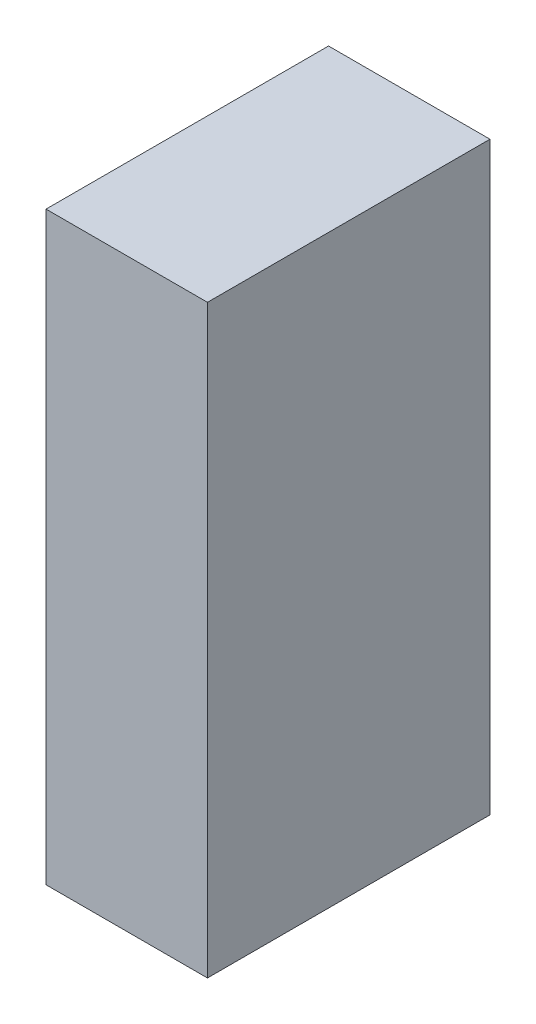
ISO-10303-21;
HEADER;
FILE_DESCRIPTION(('STEP AP214'),'2;1');
FILE_NAME('part.step','',(''),(''),'','','');
FILE_SCHEMA(('AUTOMOTIVE_DESIGN { 1 0 10303 214 1 1 1 1 }'));
ENDSEC;
DATA;
#1=APPLICATION_CONTEXT('core data for automotive mechanical design processes');
#2=APPLICATION_PROTOCOL_DEFINITION('international standard','automotive_design',2000,#1);
#3=PRODUCT_CONTEXT('',#1,'mechanical');
#4=PRODUCT('Part','Part','',(#3));
#5=PRODUCT_RELATED_PRODUCT_CATEGORY('part','',(#4));
#6=PRODUCT_DEFINITION_FORMATION('','',#4);
#7=PRODUCT_DEFINITION_CONTEXT('part definition',#1,'design');
#8=PRODUCT_DEFINITION('design','',#6,#7);
#9=PRODUCT_DEFINITION_SHAPE('','',#8);
#10=(LENGTH_UNIT() NAMED_UNIT(*) SI_UNIT(.MILLI.,.METRE.));
#11=(NAMED_UNIT(*) PLANE_ANGLE_UNIT() SI_UNIT($,.RADIAN.));
#12=(NAMED_UNIT(*) SI_UNIT($,.STERADIAN.) SOLID_ANGLE_UNIT());
#13=UNCERTAINTY_MEASURE_WITH_UNIT(LENGTH_MEASURE(1.E-05),#10,'distance_accuracy_value','');
#14=(GEOMETRIC_REPRESENTATION_CONTEXT(3) GLOBAL_UNCERTAINTY_ASSIGNED_CONTEXT((#13)) GLOBAL_UNIT_ASSIGNED_CONTEXT((#10,
#11,#12)) REPRESENTATION_CONTEXT('',''));
#15=CARTESIAN_POINT('',(0.,0.,0.));
#16=DIRECTION('',(0.,0.,1.));
#17=DIRECTION('',(1.,0.,0.));
#18=AXIS2_PLACEMENT_3D('',#15,#16,#17);
#19=CARTESIAN_POINT('',(0.700006996896874,0.724992019029173,0.));
#20=DIRECTION('',(-1.,1.19248806385031E-08,0.));
#21=DIRECTION('',(-1.19248806385031E-08,-1.,0.));
#22=AXIS2_PLACEMENT_3D('',#19,#20,#21);
#23=PLANE('',#22);
#24=DIRECTION('',(-1.1924880607005E-08,-1.,0.));
#25=VECTOR('',#24,1.);
#26=CARTESIAN_POINT('',(0.700006996896874,0.724992019029173,0.));
#27=LINE('',#26,#25);
#28=CARTESIAN_POINT('',(0.700006996896874,0.724992019029173,0.));
#29=VERTEX_POINT('',#28);
#30=CARTESIAN_POINT('',(0.700006979605831,-0.725004929213014,0.));
#31=VERTEX_POINT('',#30);
#32=EDGE_CURVE('E11',#29,#31,#27,.T.);
#33=ORIENTED_EDGE('',*,*,#32,.T.);
#34=DIRECTION('',(0.,0.,1.));
#35=VECTOR('',#34,1.);
#36=CARTESIAN_POINT('',(0.700006979605834,-0.725004929213014,0.));
#37=LINE('',#36,#35);
#38=CARTESIAN_POINT('',(0.700006979605831,-0.725004929213014,0.700001120567322));
#39=VERTEX_POINT('',#38);
#40=EDGE_CURVE('E88',#31,#39,#37,.T.);
#41=ORIENTED_EDGE('',*,*,#40,.T.);
#42=DIRECTION('',(-1.1924880607005E-08,-1.,0.));
#43=VECTOR('',#42,1.);
#44=CARTESIAN_POINT('',(0.700006996896874,0.724992019029173,0.700001120567322));
#45=LINE('',#44,#43);
#46=CARTESIAN_POINT('',(0.700006996896874,0.724992019029173,0.700001120567322));
#47=VERTEX_POINT('',#46);
#48=EDGE_CURVE('E83',#47,#39,#45,.T.);
#49=ORIENTED_EDGE('',*,*,#48,.F.);
#50=DIRECTION('',(0.,0.,1.));
#51=VECTOR('',#50,1.);
#52=CARTESIAN_POINT('',(0.700006996896874,0.724992019029157,0.));
#53=LINE('',#52,#51);
#54=EDGE_CURVE('E72',#29,#47,#53,.T.);
#55=ORIENTED_EDGE('',*,*,#54,.F.);
#56=EDGE_LOOP('',(#33,#41,#49,#55));
#57=FACE_BOUND('',#56,.T.);
#58=ADVANCED_FACE('F17',(#57),#23,.T.);
#59=CARTESIAN_POINT('',(0.700006979605831,-0.725004929213014,0.));
#60=DIRECTION('',(-1.19248806385031E-08,-1.,0.));
#61=DIRECTION('',(1.,-1.19248806385031E-08,0.));
#62=AXIS2_PLACEMENT_3D('',#59,#60,#61);
#63=PLANE('',#62);
#64=DIRECTION('',(1.,-1.19248805568155E-08,0.));
#65=VECTOR('',#64,1.);
#66=CARTESIAN_POINT('',(0.700006979605831,-0.725004929213014,0.));
#67=LINE('',#66,#65);
#68=CARTESIAN_POINT('',(1.10000850548474,-0.725004933983001,0.));
#69=VERTEX_POINT('',#68);
#70=EDGE_CURVE('E24',#31,#69,#67,.T.);
#71=ORIENTED_EDGE('',*,*,#70,.T.);
#72=DIRECTION('',(0.,0.,1.));
#73=VECTOR('',#72,1.);
#74=CARTESIAN_POINT('',(1.10000850548474,-0.725004933982985,0.));
#75=LINE('',#74,#73);
#76=CARTESIAN_POINT('',(1.10000850548474,-0.725004933983001,0.700001120567322));
#77=VERTEX_POINT('',#76);
#78=EDGE_CURVE('E85',#69,#77,#75,.T.);
#79=ORIENTED_EDGE('',*,*,#78,.T.);
#80=DIRECTION('',(1.,-1.19248805568155E-08,0.));
#81=VECTOR('',#80,1.);
#82=CARTESIAN_POINT('',(0.700006979605831,-0.725004929213014,0.700001120567322));
#83=LINE('',#82,#81);
#84=EDGE_CURVE('E66',#39,#77,#83,.T.);
#85=ORIENTED_EDGE('',*,*,#84,.F.);
#86=ORIENTED_EDGE('',*,*,#40,.F.);
#87=EDGE_LOOP('',(#71,#79,#85,#86));
#88=FACE_BOUND('',#87,.T.);
#89=ADVANCED_FACE('F89',(#88),#63,.T.);
#90=CARTESIAN_POINT('',(1.10000850548474,-0.725004933983001,0.));
#91=DIRECTION('',(1.,-1.19248806385031E-08,0.));
#92=DIRECTION('',(1.19248806385031E-08,1.,0.));
#93=AXIS2_PLACEMENT_3D('',#90,#91,#92);
#94=PLANE('',#93);
#95=DIRECTION('',(1.19248806835723E-08,1.,0.));
#96=VECTOR('',#95,1.);
#97=CARTESIAN_POINT('',(1.10000850548474,-0.725004933983001,0.));
#98=LINE('',#97,#96);
#99=CARTESIAN_POINT('',(1.10000852277578,0.724992014259186,0.));
#100=VERTEX_POINT('',#99);
#101=EDGE_CURVE('E62',#69,#100,#98,.T.);
#102=ORIENTED_EDGE('',*,*,#101,.T.);
#103=DIRECTION('',(0.,0.,1.));
#104=VECTOR('',#103,1.);
#105=CARTESIAN_POINT('',(1.10000852277578,0.724992014259186,0.));
#106=LINE('',#105,#104);
#107=CARTESIAN_POINT('',(1.10000852277578,0.724992014259186,0.700001120567322));
#108=VERTEX_POINT('',#107);
#109=EDGE_CURVE('E55',#100,#108,#106,.T.);
#110=ORIENTED_EDGE('',*,*,#109,.T.);
#111=DIRECTION('',(1.19248806835723E-08,1.,0.));
#112=VECTOR('',#111,1.);
#113=CARTESIAN_POINT('',(1.10000850548474,-0.725004933983001,0.700001120567322));
#114=LINE('',#113,#112);
#115=EDGE_CURVE('E59',#77,#108,#114,.T.);
#116=ORIENTED_EDGE('',*,*,#115,.F.);
#117=ORIENTED_EDGE('',*,*,#78,.F.);
#118=EDGE_LOOP('',(#102,#110,#116,#117));
#119=FACE_BOUND('',#118,.T.);
#120=ADVANCED_FACE('F57',(#119),#94,.T.);
#121=CARTESIAN_POINT('',(1.10000852277578,0.724992014259186,0.));
#122=DIRECTION('',(1.19248806385031E-08,1.,0.));
#123=DIRECTION('',(-1.,1.19248806385031E-08,0.));
#124=AXIS2_PLACEMENT_3D('',#121,#122,#123);
#125=PLANE('',#124);
#126=DIRECTION('',(-1.,1.19248805568155E-08,0.));
#127=VECTOR('',#126,1.);
#128=CARTESIAN_POINT('',(1.10000852277578,0.724992014259186,0.));
#129=LINE('',#128,#127);
#130=EDGE_CURVE('E65',#100,#29,#129,.T.);
#131=ORIENTED_EDGE('',*,*,#130,.T.);
#132=ORIENTED_EDGE('',*,*,#54,.T.);
#133=DIRECTION('',(-1.,1.19248805568155E-08,0.));
#134=VECTOR('',#133,1.);
#135=CARTESIAN_POINT('',(1.10000852277578,0.724992014259186,0.700001120567322));
#136=LINE('',#135,#134);
#137=EDGE_CURVE('E70',#108,#47,#136,.T.);
#138=ORIENTED_EDGE('',*,*,#137,.F.);
#139=ORIENTED_EDGE('',*,*,#109,.F.);
#140=EDGE_LOOP('',(#131,#132,#138,#139));
#141=FACE_BOUND('',#140,.T.);
#142=ADVANCED_FACE('F71',(#141),#125,.T.);
#143=CARTESIAN_POINT('',(99.1750030517578,-202.150009155273,0.700001120567322));
#144=DIRECTION('',(0.,0.,1.));
#145=DIRECTION('',(1.19248806385031E-08,1.,0.));
#146=AXIS2_PLACEMENT_3D('',#143,#144,#145);
#147=PLANE('',#146);
#148=ORIENTED_EDGE('',*,*,#48,.T.);
#149=ORIENTED_EDGE('',*,*,#84,.T.);
#150=ORIENTED_EDGE('',*,*,#115,.T.);
#151=ORIENTED_EDGE('',*,*,#137,.T.);
#152=EDGE_LOOP('',(#148,#149,#150,#151));
#153=FACE_BOUND('',#152,.T.);
#154=ADVANCED_FACE('F76',(#153),#147,.T.);
#155=CARTESIAN_POINT('',(99.1750030517578,-202.150009155273,0.));
#156=DIRECTION('',(0.,0.,1.));
#157=DIRECTION('',(1.19248806385031E-08,1.,0.));
#158=AXIS2_PLACEMENT_3D('',#155,#156,#157);
#159=PLANE('',#158);
#160=ORIENTED_EDGE('',*,*,#130,.F.);
#161=ORIENTED_EDGE('',*,*,#101,.F.);
#162=ORIENTED_EDGE('',*,*,#70,.F.);
#163=ORIENTED_EDGE('',*,*,#32,.F.);
#164=EDGE_LOOP('',(#160,#161,#162,#163));
#165=FACE_BOUND('',#164,.T.);
#166=ADVANCED_FACE('F91',(#165),#159,.F.);
#167=CLOSED_SHELL('',(#58,#89,#120,#142,#154,#166));
#168=MANIFOLD_SOLID_BREP('B1',#167);
#169=ADVANCED_BREP_SHAPE_REPRESENTATION('',(#18,#168),#14);
#170=SHAPE_DEFINITION_REPRESENTATION(#9,#169);
ENDSEC;
END-ISO-10303-21;
